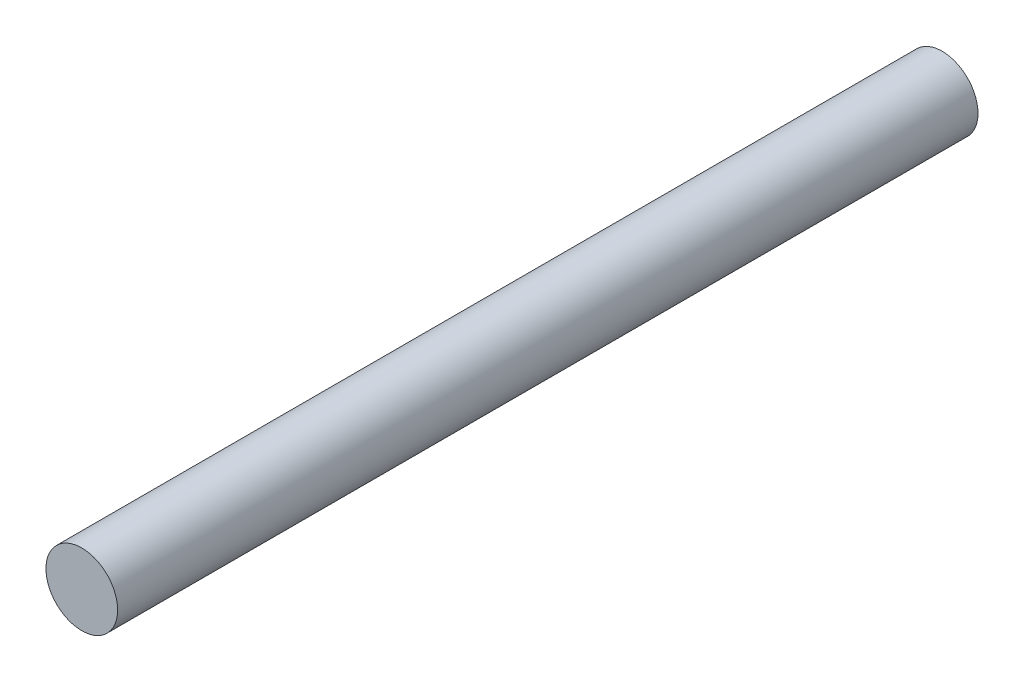
ISO-10303-21;
HEADER;
FILE_DESCRIPTION(('STEP AP214'),'2;1');
FILE_NAME('part.step','',(''),(''),'','','');
FILE_SCHEMA(('AUTOMOTIVE_DESIGN { 1 0 10303 214 1 1 1 1 }'));
ENDSEC;
DATA;
#1=APPLICATION_CONTEXT('core data for automotive mechanical design processes');
#2=APPLICATION_PROTOCOL_DEFINITION('international standard','automotive_design',2000,#1);
#3=PRODUCT_CONTEXT('',#1,'mechanical');
#4=PRODUCT('Part','Part','',(#3));
#5=PRODUCT_RELATED_PRODUCT_CATEGORY('part','',(#4));
#6=PRODUCT_DEFINITION_FORMATION('','',#4);
#7=PRODUCT_DEFINITION_CONTEXT('part definition',#1,'design');
#8=PRODUCT_DEFINITION('design','',#6,#7);
#9=PRODUCT_DEFINITION_SHAPE('','',#8);
#10=(LENGTH_UNIT() NAMED_UNIT(*) SI_UNIT(.MILLI.,.METRE.));
#11=(NAMED_UNIT(*) PLANE_ANGLE_UNIT() SI_UNIT($,.RADIAN.));
#12=(NAMED_UNIT(*) SI_UNIT($,.STERADIAN.) SOLID_ANGLE_UNIT());
#13=UNCERTAINTY_MEASURE_WITH_UNIT(LENGTH_MEASURE(1.E-05),#10,'distance_accuracy_value','');
#14=(GEOMETRIC_REPRESENTATION_CONTEXT(3) GLOBAL_UNCERTAINTY_ASSIGNED_CONTEXT((#13)) GLOBAL_UNIT_ASSIGNED_CONTEXT((#10,
#11,#12)) REPRESENTATION_CONTEXT('',''));
#15=CARTESIAN_POINT('',(0.,0.,0.));
#16=DIRECTION('',(0.,0.,1.));
#17=DIRECTION('',(1.,0.,0.));
#18=AXIS2_PLACEMENT_3D('',#15,#16,#17);
#19=CARTESIAN_POINT('',(0.,0.,152.4));
#20=DIRECTION('',(0.,0.,-1.));
#21=DIRECTION('',(-1.,0.,0.));
#22=AXIS2_PLACEMENT_3D('',#19,#20,#21);
#23=CYLINDRICAL_SURFACE('',#22,6.35);
#24=CARTESIAN_POINT('',(0.,0.,152.4));
#25=DIRECTION('',(0.,0.,1.));
#26=DIRECTION('',(1.,0.,0.));
#27=AXIS2_PLACEMENT_3D('',#24,#25,#26);
#28=CIRCLE('',#27,6.35);
#29=CARTESIAN_POINT('',(6.35,0.,152.4));
#30=VERTEX_POINT('',#29);
#31=EDGE_CURVE('E10',#30,#30,#28,.T.);
#32=ORIENTED_EDGE('',*,*,#31,.F.);
#33=EDGE_LOOP('',(#32));
#34=FACE_BOUND('',#33,.T.);
#35=CARTESIAN_POINT('',(0.,0.,0.));
#36=DIRECTION('',(0.,0.,1.));
#37=DIRECTION('',(1.,0.,0.));
#38=AXIS2_PLACEMENT_3D('',#35,#36,#37);
#39=CIRCLE('',#38,6.35);
#40=CARTESIAN_POINT('',(6.35,0.,0.));
#41=VERTEX_POINT('',#40);
#42=EDGE_CURVE('E34',#41,#41,#39,.T.);
#43=ORIENTED_EDGE('',*,*,#42,.T.);
#44=EDGE_LOOP('',(#43));
#45=FACE_BOUND('',#44,.T.);
#46=ADVANCED_FACE('F31',(#34,#45),#23,.T.);
#47=CARTESIAN_POINT('',(0.,0.,152.4));
#48=DIRECTION('',(0.,0.,1.));
#49=DIRECTION('',(1.,0.,0.));
#50=AXIS2_PLACEMENT_3D('',#47,#48,#49);
#51=PLANE('',#50);
#52=ORIENTED_EDGE('',*,*,#31,.T.);
#53=EDGE_LOOP('',(#52));
#54=FACE_BOUND('',#53,.T.);
#55=ADVANCED_FACE('F46',(#54),#51,.T.);
#56=CARTESIAN_POINT('',(0.,0.,0.));
#57=DIRECTION('',(0.,0.,1.));
#58=DIRECTION('',(1.,0.,0.));
#59=AXIS2_PLACEMENT_3D('',#56,#57,#58);
#60=PLANE('',#59);
#61=ORIENTED_EDGE('',*,*,#42,.F.);
#62=EDGE_LOOP('',(#61));
#63=FACE_BOUND('',#62,.T.);
#64=ADVANCED_FACE('F44',(#63),#60,.F.);
#65=CLOSED_SHELL('',(#46,#55,#64));
#66=MANIFOLD_SOLID_BREP('B2',#65);
#67=ADVANCED_BREP_SHAPE_REPRESENTATION('',(#18,#66),#14);
#68=SHAPE_DEFINITION_REPRESENTATION(#9,#67);
ENDSEC;
END-ISO-10303-21;
